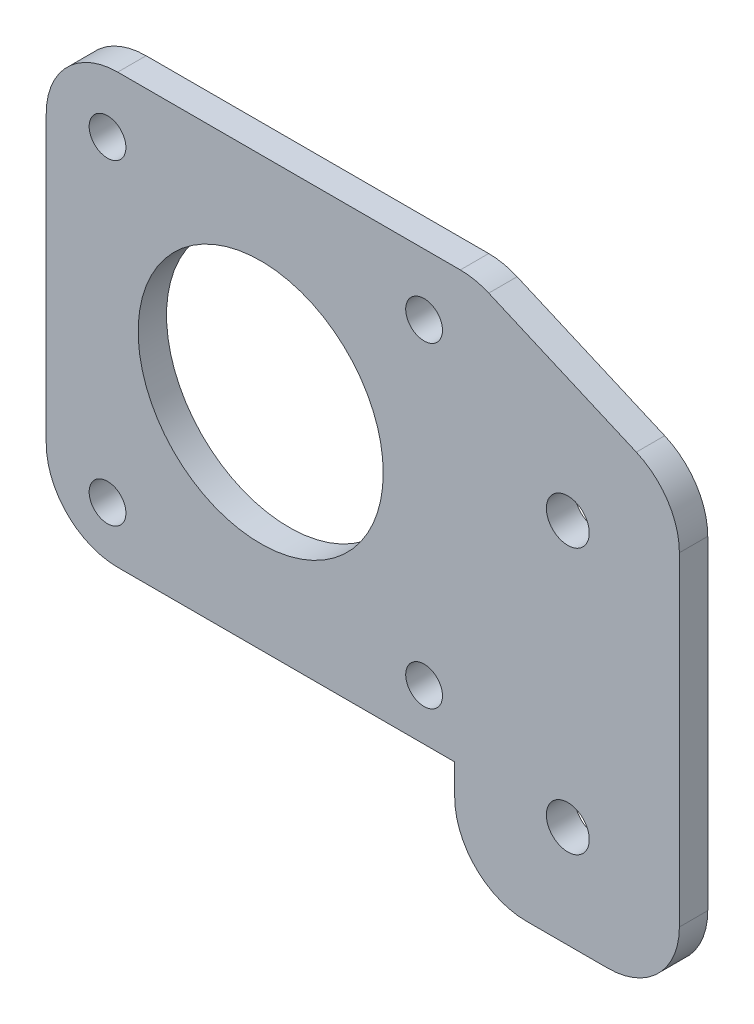
ISO-10303-21;
HEADER;
FILE_DESCRIPTION(('STEP AP214'),'2;1');
FILE_NAME('part.step','',(''),(''),'','','');
FILE_SCHEMA(('AUTOMOTIVE_DESIGN { 1 0 10303 214 1 1 1 1 }'));
ENDSEC;
DATA;
#1=APPLICATION_CONTEXT('core data for automotive mechanical design processes');
#2=APPLICATION_PROTOCOL_DEFINITION('international standard','automotive_design',2000,#1);
#3=PRODUCT_CONTEXT('',#1,'mechanical');
#4=PRODUCT('Part','Part','',(#3));
#5=PRODUCT_RELATED_PRODUCT_CATEGORY('part','',(#4));
#6=PRODUCT_DEFINITION_FORMATION('','',#4);
#7=PRODUCT_DEFINITION_CONTEXT('part definition',#1,'design');
#8=PRODUCT_DEFINITION('design','',#6,#7);
#9=PRODUCT_DEFINITION_SHAPE('','',#8);
#10=(LENGTH_UNIT() NAMED_UNIT(*) SI_UNIT(.MILLI.,.METRE.));
#11=(NAMED_UNIT(*) PLANE_ANGLE_UNIT() SI_UNIT($,.RADIAN.));
#12=(NAMED_UNIT(*) SI_UNIT($,.STERADIAN.) SOLID_ANGLE_UNIT());
#13=UNCERTAINTY_MEASURE_WITH_UNIT(LENGTH_MEASURE(1.E-05),#10,'distance_accuracy_value','');
#14=(GEOMETRIC_REPRESENTATION_CONTEXT(3) GLOBAL_UNCERTAINTY_ASSIGNED_CONTEXT((#13)) GLOBAL_UNIT_ASSIGNED_CONTEXT((#10,
#11,#12)) REPRESENTATION_CONTEXT('',''));
#15=CARTESIAN_POINT('',(0.,0.,0.));
#16=DIRECTION('',(0.,0.,1.));
#17=DIRECTION('',(1.,0.,0.));
#18=AXIS2_PLACEMENT_3D('',#15,#16,#17);
#19=CARTESIAN_POINT('',(-62.,30.4655172413793,2.778125));
#20=DIRECTION('',(1.,0.,0.));
#21=DIRECTION('',(0.,1.,0.));
#22=AXIS2_PLACEMENT_3D('',#19,#20,#21);
#23=PLANE('',#22);
#24=DIRECTION('',(0.,-1.,0.));
#25=VECTOR('',#24,1.);
#26=CARTESIAN_POINT('',(-62.,30.4655172413793,0.));
#27=LINE('',#26,#25);
#28=CARTESIAN_POINT('',(-62.,23.4655172413793,0.));
#29=VERTEX_POINT('',#28);
#30=CARTESIAN_POINT('',(-62.,-4.53448275862067,0.));
#31=VERTEX_POINT('',#30);
#32=EDGE_CURVE('E162',#29,#31,#27,.T.);
#33=ORIENTED_EDGE('',*,*,#32,.T.);
#34=DIRECTION('',(0.,0.,1.));
#35=VECTOR('',#34,1.);
#36=CARTESIAN_POINT('',(-62.,-4.53448275862067,2.778125));
#37=LINE('',#36,#35);
#38=CARTESIAN_POINT('',(-62.,-4.53448275862067,2.778125));
#39=VERTEX_POINT('',#38);
#40=EDGE_CURVE('E214',#31,#39,#37,.T.);
#41=ORIENTED_EDGE('',*,*,#40,.T.);
#42=DIRECTION('',(0.,-1.,0.));
#43=VECTOR('',#42,1.);
#44=CARTESIAN_POINT('',(-62.,30.4655172413793,2.778125));
#45=LINE('',#44,#43);
#46=CARTESIAN_POINT('',(-62.,23.4655172413793,2.778125));
#47=VERTEX_POINT('',#46);
#48=EDGE_CURVE('E163',#47,#39,#45,.T.);
#49=ORIENTED_EDGE('',*,*,#48,.F.);
#50=DIRECTION('',(0.,0.,-1.));
#51=VECTOR('',#50,1.);
#52=CARTESIAN_POINT('',(-62.,23.4655172413793,2.778125));
#53=LINE('',#52,#51);
#54=EDGE_CURVE('E211',#47,#29,#53,.T.);
#55=ORIENTED_EDGE('',*,*,#54,.T.);
#56=EDGE_LOOP('',(#33,#41,#49,#55));
#57=FACE_BOUND('',#56,.T.);
#58=ADVANCED_FACE('F32',(#57),#23,.F.);
#59=CARTESIAN_POINT('',(-62.,-21.5344827586207,2.778125));
#60=DIRECTION('',(0.,1.,0.));
#61=DIRECTION('',(0.,0.,1.));
#62=AXIS2_PLACEMENT_3D('',#59,#60,#61);
#63=PLANE('',#62);
#64=DIRECTION('',(1.,0.,0.));
#65=VECTOR('',#64,1.);
#66=CARTESIAN_POINT('',(-62.,-21.5344827586207,0.));
#67=LINE('',#66,#65);
#68=CARTESIAN_POINT('',(-15.,-21.5344827586207,0.));
#69=VERTEX_POINT('',#68);
#70=CARTESIAN_POINT('',(-6.99999999999999,-21.5344827586207,0.));
#71=VERTEX_POINT('',#70);
#72=EDGE_CURVE('E177',#69,#71,#67,.T.);
#73=ORIENTED_EDGE('',*,*,#72,.T.);
#74=DIRECTION('',(0.,0.,-1.));
#75=VECTOR('',#74,1.);
#76=CARTESIAN_POINT('',(-6.99999999999999,-21.5344827586207,2.778125));
#77=LINE('',#76,#75);
#78=CARTESIAN_POINT('',(-6.99999999999999,-21.5344827586207,2.778125));
#79=VERTEX_POINT('',#78);
#80=EDGE_CURVE('E201',#71,#79,#77,.F.);
#81=ORIENTED_EDGE('',*,*,#80,.T.);
#82=DIRECTION('',(1.,0.,0.));
#83=VECTOR('',#82,1.);
#84=CARTESIAN_POINT('',(-62.,-21.5344827586207,2.778125));
#85=LINE('',#84,#83);
#86=CARTESIAN_POINT('',(-15.,-21.5344827586207,2.778125));
#87=VERTEX_POINT('',#86);
#88=EDGE_CURVE('E165',#87,#79,#85,.T.);
#89=ORIENTED_EDGE('',*,*,#88,.F.);
#90=DIRECTION('',(0.,0.,1.));
#91=VECTOR('',#90,1.);
#92=CARTESIAN_POINT('',(-15.,-21.5344827586207,2.778125));
#93=LINE('',#92,#91);
#94=EDGE_CURVE('E199',#87,#69,#93,.F.);
#95=ORIENTED_EDGE('',*,*,#94,.T.);
#96=EDGE_LOOP('',(#73,#81,#89,#95));
#97=FACE_BOUND('',#96,.T.);
#98=ADVANCED_FACE('F272',(#97),#63,.F.);
#99=CARTESIAN_POINT('',(0.,30.4655172413793,2.778125));
#100=DIRECTION('',(-1.,0.,0.));
#101=DIRECTION('',(0.,-1.,0.));
#102=AXIS2_PLACEMENT_3D('',#99,#100,#101);
#103=PLANE('',#102);
#104=DIRECTION('',(0.,1.,0.));
#105=VECTOR('',#104,1.);
#106=CARTESIAN_POINT('',(0.,30.4655172413793,0.));
#107=LINE('',#106,#105);
#108=CARTESIAN_POINT('',(0.,-14.5344827586207,0.));
#109=VERTEX_POINT('',#108);
#110=CARTESIAN_POINT('',(0.,17.2060603609804,0.));
#111=VERTEX_POINT('',#110);
#112=EDGE_CURVE('E180',#109,#111,#107,.T.);
#113=ORIENTED_EDGE('',*,*,#112,.T.);
#114=DIRECTION('',(0.,0.,1.));
#115=VECTOR('',#114,1.);
#116=CARTESIAN_POINT('',(0.,17.2060603609804,2.778125));
#117=LINE('',#116,#115);
#118=CARTESIAN_POINT('',(0.,17.2060603609804,2.778125));
#119=VERTEX_POINT('',#118);
#120=EDGE_CURVE('E11',#111,#119,#117,.T.);
#121=ORIENTED_EDGE('',*,*,#120,.T.);
#122=DIRECTION('',(0.,1.,0.));
#123=VECTOR('',#122,1.);
#124=CARTESIAN_POINT('',(0.,30.4655172413793,2.778125));
#125=LINE('',#124,#123);
#126=CARTESIAN_POINT('',(0.,-14.5344827586207,2.778125));
#127=VERTEX_POINT('',#126);
#128=EDGE_CURVE('E169',#127,#119,#125,.T.);
#129=ORIENTED_EDGE('',*,*,#128,.F.);
#130=DIRECTION('',(0.,0.,-1.));
#131=VECTOR('',#130,1.);
#132=CARTESIAN_POINT('',(0.,-14.5344827586207,2.778125));
#133=LINE('',#132,#131);
#134=EDGE_CURVE('E187',#127,#109,#133,.T.);
#135=ORIENTED_EDGE('',*,*,#134,.T.);
#136=EDGE_LOOP('',(#113,#121,#129,#135));
#137=FACE_BOUND('',#136,.T.);
#138=ADVANCED_FACE('F278',(#137),#103,.F.);
#139=CARTESIAN_POINT('',(-62.,30.4655172413793,2.778125));
#140=DIRECTION('',(0.,-1.,0.));
#141=DIRECTION('',(0.,0.,-1.));
#142=AXIS2_PLACEMENT_3D('',#139,#140,#141);
#143=PLANE('',#142);
#144=DIRECTION('',(-1.,0.,0.));
#145=VECTOR('',#144,1.);
#146=CARTESIAN_POINT('',(-62.,30.4655172413793,2.778125));
#147=LINE('',#146,#145);
#148=CARTESIAN_POINT('',(-21.4509049232147,30.4655172413793,2.778125));
#149=VERTEX_POINT('',#148);
#150=CARTESIAN_POINT('',(-55.,30.4655172413793,2.778125));
#151=VERTEX_POINT('',#150);
#152=EDGE_CURVE('E172',#149,#151,#147,.T.);
#153=ORIENTED_EDGE('',*,*,#152,.F.);
#154=DIRECTION('',(0.,0.,1.));
#155=VECTOR('',#154,1.);
#156=CARTESIAN_POINT('',(-21.4509049232147,30.4655172413793,2.778125));
#157=LINE('',#156,#155);
#158=CARTESIAN_POINT('',(-21.4509049232147,30.4655172413793,0.));
#159=VERTEX_POINT('',#158);
#160=EDGE_CURVE('E57',#149,#159,#157,.F.);
#161=ORIENTED_EDGE('',*,*,#160,.T.);
#162=DIRECTION('',(-1.,0.,0.));
#163=VECTOR('',#162,1.);
#164=CARTESIAN_POINT('',(-62.,30.4655172413793,0.));
#165=LINE('',#164,#163);
#166=CARTESIAN_POINT('',(-55.,30.4655172413793,0.));
#167=VERTEX_POINT('',#166);
#168=EDGE_CURVE('E166',#159,#167,#165,.T.);
#169=ORIENTED_EDGE('',*,*,#168,.T.);
#170=DIRECTION('',(0.,0.,-1.));
#171=VECTOR('',#170,1.);
#172=CARTESIAN_POINT('',(-55.,30.4655172413793,2.778125));
#173=LINE('',#172,#171);
#174=EDGE_CURVE('E219',#167,#151,#173,.F.);
#175=ORIENTED_EDGE('',*,*,#174,.T.);
#176=EDGE_LOOP('',(#153,#161,#169,#175));
#177=FACE_BOUND('',#176,.T.);
#178=ADVANCED_FACE('F329',(#177),#143,.F.);
#179=CARTESIAN_POINT('',(0.,0.,2.778125));
#180=DIRECTION('',(0.,0.,1.));
#181=DIRECTION('',(1.,0.,0.));
#182=AXIS2_PLACEMENT_3D('',#179,#180,#181);
#183=PLANE('',#182);
#184=CARTESIAN_POINT('',(-10.9259711483496,-11.5344827586207,2.778125));
#185=DIRECTION('',(0.,0.,1.));
#186=DIRECTION('',(1.,0.,0.));
#187=AXIS2_PLACEMENT_3D('',#184,#185,#186);
#188=CIRCLE('',#187,2.1);
#189=CARTESIAN_POINT('',(-8.82597114834959,-11.5344827586207,2.778125));
#190=VERTEX_POINT('',#189);
#191=EDGE_CURVE('E238',#190,#190,#188,.T.);
#192=ORIENTED_EDGE('',*,*,#191,.F.);
#193=EDGE_LOOP('',(#192));
#194=FACE_BOUND('',#193,.T.);
#195=CARTESIAN_POINT('',(-41.,9.46816955467966,2.778125));
#196=DIRECTION('',(0.,0.,1.));
#197=DIRECTION('',(1.,0.,0.));
#198=AXIS2_PLACEMENT_3D('',#195,#196,#197);
#199=CIRCLE('',#198,12.);
#200=CARTESIAN_POINT('',(-29.,9.46816955467966,2.778125));
#201=VERTEX_POINT('',#200);
#202=EDGE_CURVE('E385',#201,#201,#199,.T.);
#203=ORIENTED_EDGE('',*,*,#202,.F.);
#204=EDGE_LOOP('',(#203));
#205=FACE_BOUND('',#204,.T.);
#206=CARTESIAN_POINT('',(-25.,-6.53448275862067,2.778125));
#207=DIRECTION('',(0.,0.,1.));
#208=DIRECTION('',(1.,0.,0.));
#209=AXIS2_PLACEMENT_3D('',#206,#207,#208);
#210=CIRCLE('',#209,1.8);
#211=CARTESIAN_POINT('',(-23.2,-6.53448275862067,2.778125));
#212=VERTEX_POINT('',#211);
#213=EDGE_CURVE('E368',#212,#212,#210,.T.);
#214=ORIENTED_EDGE('',*,*,#213,.F.);
#215=EDGE_LOOP('',(#214));
#216=FACE_BOUND('',#215,.T.);
#217=CARTESIAN_POINT('',(-25.,24.4655172413793,2.778125));
#218=DIRECTION('',(0.,0.,1.));
#219=DIRECTION('',(1.,0.,0.));
#220=AXIS2_PLACEMENT_3D('',#217,#218,#219);
#221=CIRCLE('',#220,1.8);
#222=CARTESIAN_POINT('',(-23.2,24.4655172413793,2.778125));
#223=VERTEX_POINT('',#222);
#224=EDGE_CURVE('E384',#223,#223,#221,.T.);
#225=ORIENTED_EDGE('',*,*,#224,.F.);
#226=EDGE_LOOP('',(#225));
#227=FACE_BOUND('',#226,.T.);
#228=CARTESIAN_POINT('',(-56.,24.4655172413793,2.778125));
#229=DIRECTION('',(0.,0.,1.));
#230=DIRECTION('',(1.,0.,0.));
#231=AXIS2_PLACEMENT_3D('',#228,#229,#230);
#232=CIRCLE('',#231,1.8);
#233=CARTESIAN_POINT('',(-54.2,24.4655172413793,2.778125));
#234=VERTEX_POINT('',#233);
#235=EDGE_CURVE('E388',#234,#234,#232,.T.);
#236=ORIENTED_EDGE('',*,*,#235,.F.);
#237=EDGE_LOOP('',(#236));
#238=FACE_BOUND('',#237,.T.);
#239=CARTESIAN_POINT('',(-56.,-6.53448275862067,2.778125));
#240=DIRECTION('',(0.,0.,1.));
#241=DIRECTION('',(1.,0.,0.));
#242=AXIS2_PLACEMENT_3D('',#239,#240,#241);
#243=CIRCLE('',#242,1.8);
#244=CARTESIAN_POINT('',(-54.2,-6.53448275862067,2.778125));
#245=VERTEX_POINT('',#244);
#246=EDGE_CURVE('E396',#245,#245,#243,.T.);
#247=ORIENTED_EDGE('',*,*,#246,.F.);
#248=EDGE_LOOP('',(#247));
#249=FACE_BOUND('',#248,.T.);
#250=CARTESIAN_POINT('',(-10.9259711483496,14.4655172413793,2.778125));
#251=DIRECTION('',(0.,0.,1.));
#252=DIRECTION('',(1.,0.,0.));
#253=AXIS2_PLACEMENT_3D('',#250,#251,#252);
#254=CIRCLE('',#253,2.1);
#255=CARTESIAN_POINT('',(-8.82597114834959,14.4655172413793,2.778125));
#256=VERTEX_POINT('',#255);
#257=EDGE_CURVE('E393',#256,#256,#254,.T.);
#258=ORIENTED_EDGE('',*,*,#257,.F.);
#259=EDGE_LOOP('',(#258));
#260=FACE_BOUND('',#259,.T.);
#261=DIRECTION('',(0.917615891077637,-0.397468333885599,0.));
#262=VECTOR('',#261,1.);
#263=CARTESIAN_POINT('',(-20.,30.4655172413793,2.778125));
#264=LINE('',#263,#262);
#265=CARTESIAN_POINT('',(-18.6686265860155,29.8888284789228,2.778125));
#266=VERTEX_POINT('',#265);
#267=CARTESIAN_POINT('',(-4.21772166280081,23.6293715985238,2.778125));
#268=VERTEX_POINT('',#267);
#269=EDGE_CURVE('E151',#266,#268,#264,.T.);
#270=ORIENTED_EDGE('',*,*,#269,.F.);
#271=CARTESIAN_POINT('',(-21.4509049232147,23.4655172413793,2.778125));
#272=DIRECTION('',(0.,0.,1.));
#273=DIRECTION('',(1.,0.,0.));
#274=AXIS2_PLACEMENT_3D('',#271,#272,#273);
#275=CIRCLE('',#274,7.);
#276=EDGE_CURVE('E229',#266,#149,#275,.T.);
#277=ORIENTED_EDGE('',*,*,#276,.T.);
#278=ORIENTED_EDGE('',*,*,#152,.T.);
#279=CARTESIAN_POINT('',(-55.,23.4655172413793,2.778125));
#280=DIRECTION('',(0.,0.,1.));
#281=DIRECTION('',(1.,0.,0.));
#282=AXIS2_PLACEMENT_3D('',#279,#280,#281);
#283=CIRCLE('',#282,7.);
#284=EDGE_CURVE('E203',#151,#47,#283,.T.);
#285=ORIENTED_EDGE('',*,*,#284,.T.);
#286=ORIENTED_EDGE('',*,*,#48,.T.);
#287=CARTESIAN_POINT('',(-55.,-4.53448275862067,2.778125));
#288=DIRECTION('',(0.,0.,1.));
#289=DIRECTION('',(1.,0.,0.));
#290=AXIS2_PLACEMENT_3D('',#287,#288,#289);
#291=CIRCLE('',#290,7.);
#292=CARTESIAN_POINT('',(-55.,-11.5344827586207,2.778125));
#293=VERTEX_POINT('',#292);
#294=EDGE_CURVE('E156',#39,#293,#291,.T.);
#295=ORIENTED_EDGE('',*,*,#294,.T.);
#296=DIRECTION('',(-1.,0.,0.));
#297=VECTOR('',#296,1.);
#298=CARTESIAN_POINT('',(-62.,-11.5344827586207,2.778125));
#299=LINE('',#298,#297);
#300=CARTESIAN_POINT('',(-22.,-11.5344827586207,2.778125));
#301=VERTEX_POINT('',#300);
#302=EDGE_CURVE('E143',#301,#293,#299,.T.);
#303=ORIENTED_EDGE('',*,*,#302,.F.);
#304=DIRECTION('',(0.,1.,0.));
#305=VECTOR('',#304,1.);
#306=CARTESIAN_POINT('',(-22.,-21.5344827586207,2.778125));
#307=LINE('',#306,#305);
#308=CARTESIAN_POINT('',(-22.,-14.5344827586207,2.778125));
#309=VERTEX_POINT('',#308);
#310=EDGE_CURVE('E133',#309,#301,#307,.T.);
#311=ORIENTED_EDGE('',*,*,#310,.F.);
#312=CARTESIAN_POINT('',(-15.,-14.5344827586207,2.778125));
#313=DIRECTION('',(0.,0.,1.));
#314=DIRECTION('',(1.,0.,0.));
#315=AXIS2_PLACEMENT_3D('',#312,#313,#314);
#316=CIRCLE('',#315,7.);
#317=EDGE_CURVE('E206',#309,#87,#316,.T.);
#318=ORIENTED_EDGE('',*,*,#317,.T.);
#319=ORIENTED_EDGE('',*,*,#88,.T.);
#320=CARTESIAN_POINT('',(-6.99999999999999,-14.5344827586207,2.778125));
#321=DIRECTION('',(0.,0.,1.));
#322=DIRECTION('',(1.,0.,0.));
#323=AXIS2_PLACEMENT_3D('',#320,#321,#322);
#324=CIRCLE('',#323,7.);
#325=EDGE_CURVE('E208',#79,#127,#324,.T.);
#326=ORIENTED_EDGE('',*,*,#325,.T.);
#327=ORIENTED_EDGE('',*,*,#128,.T.);
#328=CARTESIAN_POINT('',(-7.,17.2060603609804,2.778125));
#329=DIRECTION('',(0.,0.,1.));
#330=DIRECTION('',(1.,0.,0.));
#331=AXIS2_PLACEMENT_3D('',#328,#329,#330);
#332=CIRCLE('',#331,7.);
#333=EDGE_CURVE('E227',#119,#268,#332,.T.);
#334=ORIENTED_EDGE('',*,*,#333,.T.);
#335=EDGE_LOOP('',(#270,#277,#278,#285,#286,#295,#303,#311,#318,#319,#326,#327,#334));
#336=FACE_BOUND('',#335,.T.);
#337=ADVANCED_FACE('F154',(#194,#205,#216,#227,#238,#249,#260,#336),#183,.T.);
#338=CARTESIAN_POINT('',(0.,0.,0.));
#339=DIRECTION('',(0.,0.,1.));
#340=DIRECTION('',(1.,0.,0.));
#341=AXIS2_PLACEMENT_3D('',#338,#339,#340);
#342=PLANE('',#341);
#343=CARTESIAN_POINT('',(-10.9259711483496,-11.5344827586207,0.));
#344=DIRECTION('',(0.,0.,1.));
#345=DIRECTION('',(1.,0.,0.));
#346=AXIS2_PLACEMENT_3D('',#343,#344,#345);
#347=CIRCLE('',#346,2.1);
#348=CARTESIAN_POINT('',(-8.82597114834959,-11.5344827586207,0.));
#349=VERTEX_POINT('',#348);
#350=EDGE_CURVE('E36',#349,#349,#347,.T.);
#351=ORIENTED_EDGE('',*,*,#350,.T.);
#352=EDGE_LOOP('',(#351));
#353=FACE_BOUND('',#352,.T.);
#354=CARTESIAN_POINT('',(-41.,9.46816955467966,0.));
#355=DIRECTION('',(0.,0.,1.));
#356=DIRECTION('',(1.,0.,0.));
#357=AXIS2_PLACEMENT_3D('',#354,#355,#356);
#358=CIRCLE('',#357,12.);
#359=CARTESIAN_POINT('',(-29.,9.46816955467966,0.));
#360=VERTEX_POINT('',#359);
#361=EDGE_CURVE('E249',#360,#360,#358,.T.);
#362=ORIENTED_EDGE('',*,*,#361,.T.);
#363=EDGE_LOOP('',(#362));
#364=FACE_BOUND('',#363,.T.);
#365=CARTESIAN_POINT('',(-25.,-6.53448275862067,0.));
#366=DIRECTION('',(0.,0.,1.));
#367=DIRECTION('',(1.,0.,0.));
#368=AXIS2_PLACEMENT_3D('',#365,#366,#367);
#369=CIRCLE('',#368,1.8);
#370=CARTESIAN_POINT('',(-23.2,-6.53448275862067,0.));
#371=VERTEX_POINT('',#370);
#372=EDGE_CURVE('E247',#371,#371,#369,.T.);
#373=ORIENTED_EDGE('',*,*,#372,.T.);
#374=EDGE_LOOP('',(#373));
#375=FACE_BOUND('',#374,.T.);
#376=CARTESIAN_POINT('',(-25.,24.4655172413793,0.));
#377=DIRECTION('',(0.,0.,1.));
#378=DIRECTION('',(1.,0.,0.));
#379=AXIS2_PLACEMENT_3D('',#376,#377,#378);
#380=CIRCLE('',#379,1.8);
#381=CARTESIAN_POINT('',(-23.2,24.4655172413793,0.));
#382=VERTEX_POINT('',#381);
#383=EDGE_CURVE('E244',#382,#382,#380,.T.);
#384=ORIENTED_EDGE('',*,*,#383,.T.);
#385=EDGE_LOOP('',(#384));
#386=FACE_BOUND('',#385,.T.);
#387=CARTESIAN_POINT('',(-56.,24.4655172413793,0.));
#388=DIRECTION('',(0.,0.,1.));
#389=DIRECTION('',(1.,0.,0.));
#390=AXIS2_PLACEMENT_3D('',#387,#388,#389);
#391=CIRCLE('',#390,1.8);
#392=CARTESIAN_POINT('',(-54.2,24.4655172413793,0.));
#393=VERTEX_POINT('',#392);
#394=EDGE_CURVE('E241',#393,#393,#391,.T.);
#395=ORIENTED_EDGE('',*,*,#394,.T.);
#396=EDGE_LOOP('',(#395));
#397=FACE_BOUND('',#396,.T.);
#398=CARTESIAN_POINT('',(-56.,-6.53448275862067,0.));
#399=DIRECTION('',(0.,0.,1.));
#400=DIRECTION('',(1.,0.,0.));
#401=AXIS2_PLACEMENT_3D('',#398,#399,#400);
#402=CIRCLE('',#401,1.8);
#403=CARTESIAN_POINT('',(-54.2,-6.53448275862067,0.));
#404=VERTEX_POINT('',#403);
#405=EDGE_CURVE('E237',#404,#404,#402,.T.);
#406=ORIENTED_EDGE('',*,*,#405,.T.);
#407=EDGE_LOOP('',(#406));
#408=FACE_BOUND('',#407,.T.);
#409=CARTESIAN_POINT('',(-10.9259711483496,14.4655172413793,0.));
#410=DIRECTION('',(0.,0.,1.));
#411=DIRECTION('',(1.,0.,0.));
#412=AXIS2_PLACEMENT_3D('',#409,#410,#411);
#413=CIRCLE('',#412,2.1);
#414=CARTESIAN_POINT('',(-8.82597114834959,14.4655172413793,0.));
#415=VERTEX_POINT('',#414);
#416=EDGE_CURVE('E234',#415,#415,#413,.T.);
#417=ORIENTED_EDGE('',*,*,#416,.T.);
#418=EDGE_LOOP('',(#417));
#419=FACE_BOUND('',#418,.T.);
#420=ORIENTED_EDGE('',*,*,#168,.F.);
#421=CARTESIAN_POINT('',(-21.4509049232147,23.4655172413793,0.));
#422=DIRECTION('',(0.,0.,1.));
#423=DIRECTION('',(1.,0.,0.));
#424=AXIS2_PLACEMENT_3D('',#421,#422,#423);
#425=CIRCLE('',#424,7.);
#426=CARTESIAN_POINT('',(-18.6686265860155,29.8888284789228,0.));
#427=VERTEX_POINT('',#426);
#428=EDGE_CURVE('E41',#159,#427,#425,.F.);
#429=ORIENTED_EDGE('',*,*,#428,.T.);
#430=DIRECTION('',(0.917615891077637,-0.397468333885599,0.));
#431=VECTOR('',#430,1.);
#432=CARTESIAN_POINT('',(7.95186121794191,18.3580768457586,0.));
#433=LINE('',#432,#431);
#434=CARTESIAN_POINT('',(-4.21772166280081,23.6293715985238,0.));
#435=VERTEX_POINT('',#434);
#436=EDGE_CURVE('E174',#427,#435,#433,.T.);
#437=ORIENTED_EDGE('',*,*,#436,.T.);
#438=CARTESIAN_POINT('',(-7.,17.2060603609804,0.));
#439=DIRECTION('',(0.,0.,1.));
#440=DIRECTION('',(1.,0.,0.));
#441=AXIS2_PLACEMENT_3D('',#438,#439,#440);
#442=CIRCLE('',#441,7.);
#443=EDGE_CURVE('E49',#435,#111,#442,.F.);
#444=ORIENTED_EDGE('',*,*,#443,.T.);
#445=ORIENTED_EDGE('',*,*,#112,.F.);
#446=CARTESIAN_POINT('',(-6.99999999999999,-14.5344827586207,0.));
#447=DIRECTION('',(0.,0.,1.));
#448=DIRECTION('',(1.,0.,0.));
#449=AXIS2_PLACEMENT_3D('',#446,#447,#448);
#450=CIRCLE('',#449,7.);
#451=EDGE_CURVE('E197',#109,#71,#450,.F.);
#452=ORIENTED_EDGE('',*,*,#451,.T.);
#453=ORIENTED_EDGE('',*,*,#72,.F.);
#454=CARTESIAN_POINT('',(-15.,-14.5344827586207,0.));
#455=DIRECTION('',(0.,0.,1.));
#456=DIRECTION('',(1.,0.,0.));
#457=AXIS2_PLACEMENT_3D('',#454,#455,#456);
#458=CIRCLE('',#457,7.);
#459=CARTESIAN_POINT('',(-22.,-14.5344827586207,0.));
#460=VERTEX_POINT('',#459);
#461=EDGE_CURVE('E195',#69,#460,#458,.F.);
#462=ORIENTED_EDGE('',*,*,#461,.T.);
#463=DIRECTION('',(0.,1.,0.));
#464=VECTOR('',#463,1.);
#465=CARTESIAN_POINT('',(-22.,0.,0.));
#466=LINE('',#465,#464);
#467=CARTESIAN_POINT('',(-22.,-11.5344827586207,0.));
#468=VERTEX_POINT('',#467);
#469=EDGE_CURVE('E184',#460,#468,#466,.T.);
#470=ORIENTED_EDGE('',*,*,#469,.T.);
#471=DIRECTION('',(-1.,0.,0.));
#472=VECTOR('',#471,1.);
#473=CARTESIAN_POINT('',(0.,-11.5344827586207,0.));
#474=LINE('',#473,#472);
#475=CARTESIAN_POINT('',(-55.,-11.5344827586207,0.));
#476=VERTEX_POINT('',#475);
#477=EDGE_CURVE('E150',#468,#476,#474,.T.);
#478=ORIENTED_EDGE('',*,*,#477,.T.);
#479=CARTESIAN_POINT('',(-55.,-4.53448275862067,0.));
#480=DIRECTION('',(0.,0.,1.));
#481=DIRECTION('',(1.,0.,0.));
#482=AXIS2_PLACEMENT_3D('',#479,#480,#481);
#483=CIRCLE('',#482,7.);
#484=EDGE_CURVE('E193',#476,#31,#483,.F.);
#485=ORIENTED_EDGE('',*,*,#484,.T.);
#486=ORIENTED_EDGE('',*,*,#32,.F.);
#487=CARTESIAN_POINT('',(-55.,23.4655172413793,0.));
#488=DIRECTION('',(0.,0.,1.));
#489=DIRECTION('',(1.,0.,0.));
#490=AXIS2_PLACEMENT_3D('',#487,#488,#489);
#491=CIRCLE('',#490,7.);
#492=EDGE_CURVE('E190',#29,#167,#491,.F.);
#493=ORIENTED_EDGE('',*,*,#492,.T.);
#494=EDGE_LOOP('',(#420,#429,#437,#444,#445,#452,#453,#462,#470,#478,#485,#486,#493));
#495=FACE_BOUND('',#494,.T.);
#496=ADVANCED_FACE('F256',(#353,#364,#375,#386,#397,#408,#419,#495),#342,.F.);
#497=CARTESIAN_POINT('',(-20.,30.4655172413793,-7.221875));
#498=DIRECTION('',(-0.397468333885599,-0.917615891077637,0.));
#499=DIRECTION('',(0.917615891077637,-0.397468333885599,0.));
#500=AXIS2_PLACEMENT_3D('',#497,#498,#499);
#501=PLANE('',#500);
#502=ORIENTED_EDGE('',*,*,#436,.F.);
#503=DIRECTION('',(0.,0.,1.));
#504=VECTOR('',#503,1.);
#505=CARTESIAN_POINT('',(-18.6686265860155,29.8888284789228,-7.221875));
#506=LINE('',#505,#504);
#507=EDGE_CURVE('E224',#427,#266,#506,.T.);
#508=ORIENTED_EDGE('',*,*,#507,.T.);
#509=ORIENTED_EDGE('',*,*,#269,.T.);
#510=DIRECTION('',(0.,0.,1.));
#511=VECTOR('',#510,1.);
#512=CARTESIAN_POINT('',(-4.21772166280081,23.6293715985238,-7.221875));
#513=LINE('',#512,#511);
#514=EDGE_CURVE('E222',#268,#435,#513,.F.);
#515=ORIENTED_EDGE('',*,*,#514,.T.);
#516=EDGE_LOOP('',(#502,#508,#509,#515));
#517=FACE_BOUND('',#516,.T.);
#518=ADVANCED_FACE('F310',(#517),#501,.F.);
#519=CARTESIAN_POINT('',(-62.,-11.5344827586207,-7.221875));
#520=DIRECTION('',(0.,1.,0.));
#521=DIRECTION('',(0.,0.,1.));
#522=AXIS2_PLACEMENT_3D('',#519,#520,#521);
#523=PLANE('',#522);
#524=ORIENTED_EDGE('',*,*,#302,.T.);
#525=DIRECTION('',(0.,0.,1.));
#526=VECTOR('',#525,1.);
#527=CARTESIAN_POINT('',(-55.,-11.5344827586207,-7.221875));
#528=LINE('',#527,#526);
#529=EDGE_CURVE('E217',#293,#476,#528,.F.);
#530=ORIENTED_EDGE('',*,*,#529,.T.);
#531=ORIENTED_EDGE('',*,*,#477,.F.);
#532=DIRECTION('',(0.,0.,1.));
#533=VECTOR('',#532,1.);
#534=CARTESIAN_POINT('',(-22.,-11.5344827586207,-7.221875));
#535=LINE('',#534,#533);
#536=EDGE_CURVE('E137',#468,#301,#535,.T.);
#537=ORIENTED_EDGE('',*,*,#536,.T.);
#538=EDGE_LOOP('',(#524,#530,#531,#537));
#539=FACE_BOUND('',#538,.T.);
#540=ADVANCED_FACE('F147',(#539),#523,.F.);
#541=CARTESIAN_POINT('',(-22.,-21.5344827586207,-7.221875));
#542=DIRECTION('',(1.,0.,0.));
#543=DIRECTION('',(0.,0.,-1.));
#544=AXIS2_PLACEMENT_3D('',#541,#542,#543);
#545=PLANE('',#544);
#546=ORIENTED_EDGE('',*,*,#469,.F.);
#547=DIRECTION('',(0.,0.,1.));
#548=VECTOR('',#547,1.);
#549=CARTESIAN_POINT('',(-22.,-14.5344827586207,-7.221875));
#550=LINE('',#549,#548);
#551=EDGE_CURVE('E140',#460,#309,#550,.T.);
#552=ORIENTED_EDGE('',*,*,#551,.T.);
#553=ORIENTED_EDGE('',*,*,#310,.T.);
#554=ORIENTED_EDGE('',*,*,#536,.F.);
#555=EDGE_LOOP('',(#546,#552,#553,#554));
#556=FACE_BOUND('',#555,.T.);
#557=ADVANCED_FACE('F136',(#556),#545,.F.);
#558=CARTESIAN_POINT('',(-6.99999999999999,-14.5344827586207,2.778125));
#559=DIRECTION('',(0.,0.,-1.));
#560=DIRECTION('',(-1.,0.,0.));
#561=AXIS2_PLACEMENT_3D('',#558,#559,#560);
#562=CYLINDRICAL_SURFACE('',#561,7.);
#563=ORIENTED_EDGE('',*,*,#325,.F.);
#564=ORIENTED_EDGE('',*,*,#80,.F.);
#565=ORIENTED_EDGE('',*,*,#451,.F.);
#566=ORIENTED_EDGE('',*,*,#134,.F.);
#567=EDGE_LOOP('',(#563,#564,#565,#566));
#568=FACE_BOUND('',#567,.T.);
#569=ADVANCED_FACE('F283',(#568),#562,.T.);
#570=CARTESIAN_POINT('',(-15.,-14.5344827586207,-7.221875));
#571=DIRECTION('',(0.,0.,1.));
#572=DIRECTION('',(1.,0.,0.));
#573=AXIS2_PLACEMENT_3D('',#570,#571,#572);
#574=CYLINDRICAL_SURFACE('',#573,7.);
#575=ORIENTED_EDGE('',*,*,#461,.F.);
#576=ORIENTED_EDGE('',*,*,#94,.F.);
#577=ORIENTED_EDGE('',*,*,#317,.F.);
#578=ORIENTED_EDGE('',*,*,#551,.F.);
#579=EDGE_LOOP('',(#575,#576,#577,#578));
#580=FACE_BOUND('',#579,.T.);
#581=ADVANCED_FACE('F286',(#580),#574,.T.);
#582=CARTESIAN_POINT('',(-55.,-4.53448275862067,2.778125));
#583=DIRECTION('',(0.,0.,1.));
#584=DIRECTION('',(1.,0.,0.));
#585=AXIS2_PLACEMENT_3D('',#582,#583,#584);
#586=CYLINDRICAL_SURFACE('',#585,7.);
#587=ORIENTED_EDGE('',*,*,#484,.F.);
#588=ORIENTED_EDGE('',*,*,#529,.F.);
#589=ORIENTED_EDGE('',*,*,#294,.F.);
#590=ORIENTED_EDGE('',*,*,#40,.F.);
#591=EDGE_LOOP('',(#587,#588,#589,#590));
#592=FACE_BOUND('',#591,.T.);
#593=ADVANCED_FACE('F290',(#592),#586,.T.);
#594=CARTESIAN_POINT('',(-55.,23.4655172413793,2.778125));
#595=DIRECTION('',(0.,0.,-1.));
#596=DIRECTION('',(-1.,0.,0.));
#597=AXIS2_PLACEMENT_3D('',#594,#595,#596);
#598=CYLINDRICAL_SURFACE('',#597,7.);
#599=ORIENTED_EDGE('',*,*,#284,.F.);
#600=ORIENTED_EDGE('',*,*,#174,.F.);
#601=ORIENTED_EDGE('',*,*,#492,.F.);
#602=ORIENTED_EDGE('',*,*,#54,.F.);
#603=EDGE_LOOP('',(#599,#600,#601,#602));
#604=FACE_BOUND('',#603,.T.);
#605=ADVANCED_FACE('F294',(#604),#598,.T.);
#606=CARTESIAN_POINT('',(-21.4509049232147,23.4655172413793,-7.221875));
#607=DIRECTION('',(0.,0.,1.));
#608=DIRECTION('',(1.,0.,0.));
#609=AXIS2_PLACEMENT_3D('',#606,#607,#608);
#610=CYLINDRICAL_SURFACE('',#609,7.);
#611=ORIENTED_EDGE('',*,*,#428,.F.);
#612=ORIENTED_EDGE('',*,*,#160,.F.);
#613=ORIENTED_EDGE('',*,*,#276,.F.);
#614=ORIENTED_EDGE('',*,*,#507,.F.);
#615=EDGE_LOOP('',(#611,#612,#613,#614));
#616=FACE_BOUND('',#615,.T.);
#617=ADVANCED_FACE('F297',(#616),#610,.T.);
#618=CARTESIAN_POINT('',(-7.,17.2060603609804,2.778125));
#619=DIRECTION('',(0.,0.,1.));
#620=DIRECTION('',(1.,0.,0.));
#621=AXIS2_PLACEMENT_3D('',#618,#619,#620);
#622=CYLINDRICAL_SURFACE('',#621,7.);
#623=ORIENTED_EDGE('',*,*,#443,.F.);
#624=ORIENTED_EDGE('',*,*,#514,.F.);
#625=ORIENTED_EDGE('',*,*,#333,.F.);
#626=ORIENTED_EDGE('',*,*,#120,.F.);
#627=EDGE_LOOP('',(#623,#624,#625,#626));
#628=FACE_BOUND('',#627,.T.);
#629=ADVANCED_FACE('F34',(#628),#622,.T.);
#630=CARTESIAN_POINT('',(-10.9259711483496,14.4655172413793,-7.221875));
#631=DIRECTION('',(0.,0.,1.));
#632=DIRECTION('',(1.,0.,0.));
#633=AXIS2_PLACEMENT_3D('',#630,#631,#632);
#634=CYLINDRICAL_SURFACE('',#633,2.1);
#635=ORIENTED_EDGE('',*,*,#257,.T.);
#636=EDGE_LOOP('',(#635));
#637=FACE_BOUND('',#636,.T.);
#638=ORIENTED_EDGE('',*,*,#416,.F.);
#639=EDGE_LOOP('',(#638));
#640=FACE_BOUND('',#639,.T.);
#641=ADVANCED_FACE('F304',(#637,#640),#634,.F.);
#642=CARTESIAN_POINT('',(-56.,-6.53448275862067,-7.221875));
#643=DIRECTION('',(0.,0.,1.));
#644=DIRECTION('',(1.,0.,0.));
#645=AXIS2_PLACEMENT_3D('',#642,#643,#644);
#646=CYLINDRICAL_SURFACE('',#645,1.8);
#647=ORIENTED_EDGE('',*,*,#246,.T.);
#648=EDGE_LOOP('',(#647));
#649=FACE_BOUND('',#648,.T.);
#650=ORIENTED_EDGE('',*,*,#405,.F.);
#651=EDGE_LOOP('',(#650));
#652=FACE_BOUND('',#651,.T.);
#653=ADVANCED_FACE('F354',(#649,#652),#646,.F.);
#654=CARTESIAN_POINT('',(-56.,24.4655172413793,-7.221875));
#655=DIRECTION('',(0.,0.,1.));
#656=DIRECTION('',(1.,0.,0.));
#657=AXIS2_PLACEMENT_3D('',#654,#655,#656);
#658=CYLINDRICAL_SURFACE('',#657,1.8);
#659=ORIENTED_EDGE('',*,*,#235,.T.);
#660=EDGE_LOOP('',(#659));
#661=FACE_BOUND('',#660,.T.);
#662=ORIENTED_EDGE('',*,*,#394,.F.);
#663=EDGE_LOOP('',(#662));
#664=FACE_BOUND('',#663,.T.);
#665=ADVANCED_FACE('F350',(#661,#664),#658,.F.);
#666=CARTESIAN_POINT('',(-25.,24.4655172413793,-7.221875));
#667=DIRECTION('',(0.,0.,1.));
#668=DIRECTION('',(1.,0.,0.));
#669=AXIS2_PLACEMENT_3D('',#666,#667,#668);
#670=CYLINDRICAL_SURFACE('',#669,1.8);
#671=ORIENTED_EDGE('',*,*,#224,.T.);
#672=EDGE_LOOP('',(#671));
#673=FACE_BOUND('',#672,.T.);
#674=ORIENTED_EDGE('',*,*,#383,.F.);
#675=EDGE_LOOP('',(#674));
#676=FACE_BOUND('',#675,.T.);
#677=ADVANCED_FACE('F347',(#673,#676),#670,.F.);
#678=CARTESIAN_POINT('',(-25.,-6.53448275862067,-7.221875));
#679=DIRECTION('',(0.,0.,1.));
#680=DIRECTION('',(1.,0.,0.));
#681=AXIS2_PLACEMENT_3D('',#678,#679,#680);
#682=CYLINDRICAL_SURFACE('',#681,1.8);
#683=ORIENTED_EDGE('',*,*,#213,.T.);
#684=EDGE_LOOP('',(#683));
#685=FACE_BOUND('',#684,.T.);
#686=ORIENTED_EDGE('',*,*,#372,.F.);
#687=EDGE_LOOP('',(#686));
#688=FACE_BOUND('',#687,.T.);
#689=ADVANCED_FACE('F266',(#685,#688),#682,.F.);
#690=CARTESIAN_POINT('',(-41.,9.46816955467966,-7.221875));
#691=DIRECTION('',(0.,0.,1.));
#692=DIRECTION('',(1.,0.,0.));
#693=AXIS2_PLACEMENT_3D('',#690,#691,#692);
#694=CYLINDRICAL_SURFACE('',#693,12.);
#695=ORIENTED_EDGE('',*,*,#202,.T.);
#696=EDGE_LOOP('',(#695));
#697=FACE_BOUND('',#696,.T.);
#698=ORIENTED_EDGE('',*,*,#361,.F.);
#699=EDGE_LOOP('',(#698));
#700=FACE_BOUND('',#699,.T.);
#701=ADVANCED_FACE('F260',(#697,#700),#694,.F.);
#702=CARTESIAN_POINT('',(-10.9259711483496,-11.5344827586207,-7.221875));
#703=DIRECTION('',(0.,0.,1.));
#704=DIRECTION('',(1.,0.,0.));
#705=AXIS2_PLACEMENT_3D('',#702,#703,#704);
#706=CYLINDRICAL_SURFACE('',#705,2.1);
#707=ORIENTED_EDGE('',*,*,#191,.T.);
#708=EDGE_LOOP('',(#707));
#709=FACE_BOUND('',#708,.T.);
#710=ORIENTED_EDGE('',*,*,#350,.F.);
#711=EDGE_LOOP('',(#710));
#712=FACE_BOUND('',#711,.T.);
#713=ADVANCED_FACE('F258',(#709,#712),#706,.F.);
#714=CLOSED_SHELL('',(#58,#98,#138,#178,#337,#496,#518,#540,#557,#569,#581,#593,#605,#617,#629,
#641,#653,#665,#677,#689,#701,#713));
#715=MANIFOLD_SOLID_BREP('B2',#714);
#716=ADVANCED_BREP_SHAPE_REPRESENTATION('',(#18,#715),#14);
#717=SHAPE_DEFINITION_REPRESENTATION(#9,#716);
ENDSEC;
END-ISO-10303-21;
